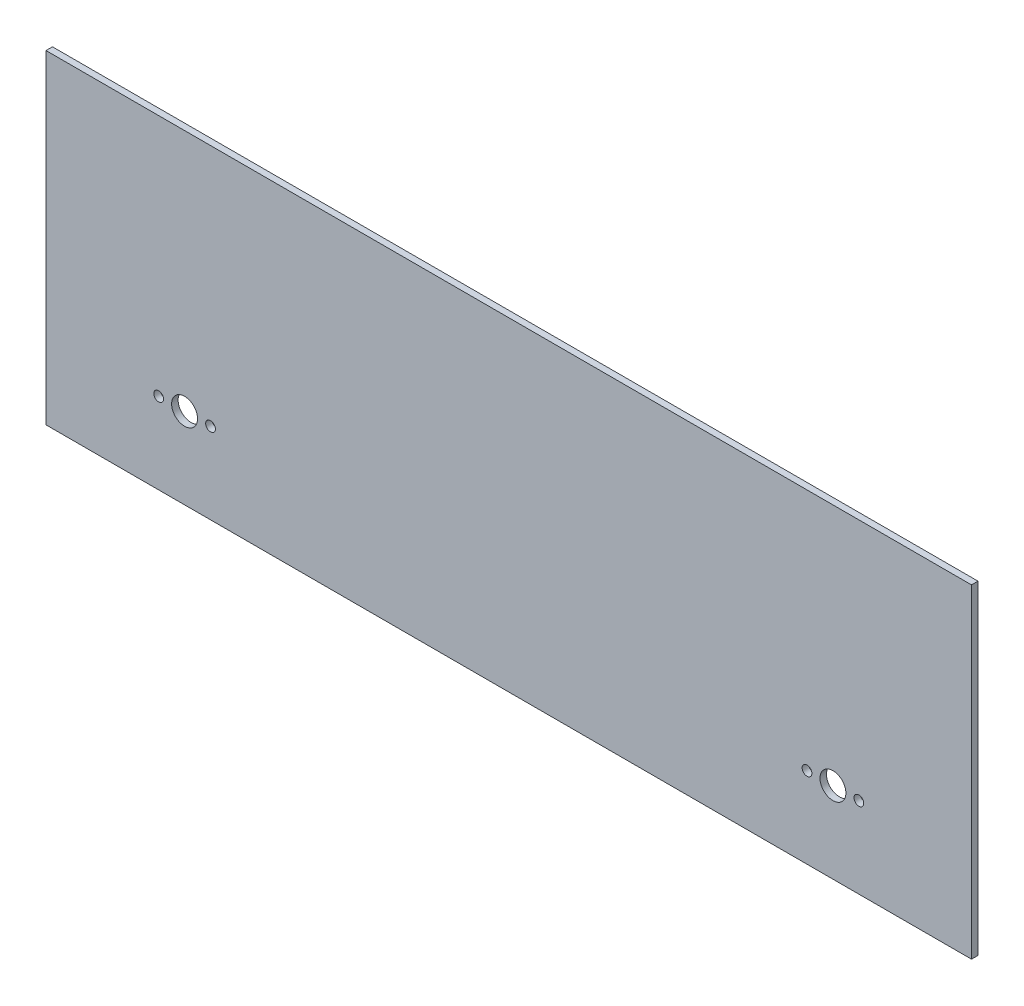
ISO-10303-21;
HEADER;
FILE_DESCRIPTION(('STEP AP214'),'2;1');
FILE_NAME('part.step','',(''),(''),'','','');
FILE_SCHEMA(('AUTOMOTIVE_DESIGN { 1 0 10303 214 1 1 1 1 }'));
ENDSEC;
DATA;
#1=APPLICATION_CONTEXT('core data for automotive mechanical design processes');
#2=APPLICATION_PROTOCOL_DEFINITION('international standard','automotive_design',2000,#1);
#3=PRODUCT_CONTEXT('',#1,'mechanical');
#4=PRODUCT('Part','Part','',(#3));
#5=PRODUCT_RELATED_PRODUCT_CATEGORY('part','',(#4));
#6=PRODUCT_DEFINITION_FORMATION('','',#4);
#7=PRODUCT_DEFINITION_CONTEXT('part definition',#1,'design');
#8=PRODUCT_DEFINITION('design','',#6,#7);
#9=PRODUCT_DEFINITION_SHAPE('','',#8);
#10=(LENGTH_UNIT() NAMED_UNIT(*) SI_UNIT(.MILLI.,.METRE.));
#11=(NAMED_UNIT(*) PLANE_ANGLE_UNIT() SI_UNIT($,.RADIAN.));
#12=(NAMED_UNIT(*) SI_UNIT($,.STERADIAN.) SOLID_ANGLE_UNIT());
#13=UNCERTAINTY_MEASURE_WITH_UNIT(LENGTH_MEASURE(1.E-05),#10,'distance_accuracy_value','');
#14=(GEOMETRIC_REPRESENTATION_CONTEXT(3) GLOBAL_UNCERTAINTY_ASSIGNED_CONTEXT((#13)) GLOBAL_UNIT_ASSIGNED_CONTEXT((#10,
#11,#12)) REPRESENTATION_CONTEXT('',''));
#15=CARTESIAN_POINT('',(0.,0.,0.));
#16=DIRECTION('',(0.,0.,1.));
#17=DIRECTION('',(1.,0.,0.));
#18=AXIS2_PLACEMENT_3D('',#15,#16,#17);
#19=CARTESIAN_POINT('',(0.,0.,2.));
#20=DIRECTION('',(0.,0.,1.));
#21=DIRECTION('',(1.,0.,0.));
#22=AXIS2_PLACEMENT_3D('',#19,#20,#21);
#23=PLANE('',#22);
#24=CARTESIAN_POINT('',(91.9999999999999,-25.,2.));
#25=DIRECTION('',(0.,0.,1.));
#26=DIRECTION('',(-1.,0.,0.));
#27=AXIS2_PLACEMENT_3D('',#24,#25,#26);
#28=CIRCLE('',#27,1.5);
#29=CARTESIAN_POINT('',(90.4999999999999,-25.,2.));
#30=VERTEX_POINT('',#29);
#31=EDGE_CURVE('E132',#30,#30,#28,.T.);
#32=ORIENTED_EDGE('',*,*,#31,.F.);
#33=EDGE_LOOP('',(#32));
#34=FACE_BOUND('',#33,.T.);
#35=CARTESIAN_POINT('',(-108.,-25.,2.));
#36=DIRECTION('',(0.,0.,1.));
#37=DIRECTION('',(1.,0.,0.));
#38=AXIS2_PLACEMENT_3D('',#35,#36,#37);
#39=CIRCLE('',#38,1.5);
#40=CARTESIAN_POINT('',(-106.5,-25.,2.));
#41=VERTEX_POINT('',#40);
#42=EDGE_CURVE('E120',#41,#41,#39,.T.);
#43=ORIENTED_EDGE('',*,*,#42,.F.);
#44=EDGE_LOOP('',(#43));
#45=FACE_BOUND('',#44,.T.);
#46=CARTESIAN_POINT('',(-99.9999999999999,-25.,2.));
#47=DIRECTION('',(0.,0.,1.));
#48=DIRECTION('',(1.,0.,0.));
#49=AXIS2_PLACEMENT_3D('',#46,#47,#48);
#50=CIRCLE('',#49,4.00000000000001);
#51=CARTESIAN_POINT('',(-95.9999999999999,-25.,2.));
#52=VERTEX_POINT('',#51);
#53=EDGE_CURVE('E99',#52,#52,#50,.T.);
#54=ORIENTED_EDGE('',*,*,#53,.F.);
#55=EDGE_LOOP('',(#54));
#56=FACE_BOUND('',#55,.T.);
#57=DIRECTION('',(0.,1.,0.));
#58=VECTOR('',#57,1.);
#59=CARTESIAN_POINT('',(142.75,50.,2.));
#60=LINE('',#59,#58);
#61=CARTESIAN_POINT('',(142.75,-50.,2.));
#62=VERTEX_POINT('',#61);
#63=CARTESIAN_POINT('',(142.75,50.,2.));
#64=VERTEX_POINT('',#63);
#65=EDGE_CURVE('E84',#62,#64,#60,.T.);
#66=ORIENTED_EDGE('',*,*,#65,.T.);
#67=DIRECTION('',(-1.,0.,0.));
#68=VECTOR('',#67,1.);
#69=CARTESIAN_POINT('',(-142.75,50.,2.));
#70=LINE('',#69,#68);
#71=CARTESIAN_POINT('',(-142.75,50.,2.));
#72=VERTEX_POINT('',#71);
#73=EDGE_CURVE('E79',#64,#72,#70,.T.);
#74=ORIENTED_EDGE('',*,*,#73,.T.);
#75=DIRECTION('',(0.,-1.,0.));
#76=VECTOR('',#75,1.);
#77=CARTESIAN_POINT('',(-142.75,50.,2.));
#78=LINE('',#77,#76);
#79=CARTESIAN_POINT('',(-142.75,-50.,2.));
#80=VERTEX_POINT('',#79);
#81=EDGE_CURVE('E82',#72,#80,#78,.T.);
#82=ORIENTED_EDGE('',*,*,#81,.T.);
#83=DIRECTION('',(1.,0.,0.));
#84=VECTOR('',#83,1.);
#85=CARTESIAN_POINT('',(-142.75,-50.,2.));
#86=LINE('',#85,#84);
#87=EDGE_CURVE('E49',#80,#62,#86,.T.);
#88=ORIENTED_EDGE('',*,*,#87,.T.);
#89=EDGE_LOOP('',(#66,#74,#82,#88));
#90=FACE_BOUND('',#89,.T.);
#91=CARTESIAN_POINT('',(-91.9999999999999,-25.,2.));
#92=DIRECTION('',(0.,0.,1.));
#93=DIRECTION('',(1.,0.,0.));
#94=AXIS2_PLACEMENT_3D('',#91,#92,#93);
#95=CIRCLE('',#94,1.5);
#96=CARTESIAN_POINT('',(-90.4999999999999,-25.,2.));
#97=VERTEX_POINT('',#96);
#98=EDGE_CURVE('E114',#97,#97,#95,.T.);
#99=ORIENTED_EDGE('',*,*,#98,.F.);
#100=EDGE_LOOP('',(#99));
#101=FACE_BOUND('',#100,.T.);
#102=CARTESIAN_POINT('',(108.,-25.,2.));
#103=DIRECTION('',(0.,0.,1.));
#104=DIRECTION('',(-1.,0.,0.));
#105=AXIS2_PLACEMENT_3D('',#102,#103,#104);
#106=CIRCLE('',#105,1.5);
#107=CARTESIAN_POINT('',(106.5,-25.,2.));
#108=VERTEX_POINT('',#107);
#109=EDGE_CURVE('E126',#108,#108,#106,.T.);
#110=ORIENTED_EDGE('',*,*,#109,.F.);
#111=EDGE_LOOP('',(#110));
#112=FACE_BOUND('',#111,.T.);
#113=CARTESIAN_POINT('',(99.9999999999999,-25.,2.));
#114=DIRECTION('',(0.,0.,1.));
#115=DIRECTION('',(-1.,0.,0.));
#116=AXIS2_PLACEMENT_3D('',#113,#114,#115);
#117=CIRCLE('',#116,4.00000000000001);
#118=CARTESIAN_POINT('',(95.9999999999999,-25.,2.));
#119=VERTEX_POINT('',#118);
#120=EDGE_CURVE('E138',#119,#119,#117,.T.);
#121=ORIENTED_EDGE('',*,*,#120,.F.);
#122=EDGE_LOOP('',(#121));
#123=FACE_BOUND('',#122,.T.);
#124=ADVANCED_FACE('F32',(#34,#45,#56,#90,#101,#112,#123),#23,.T.);
#125=CARTESIAN_POINT('',(0.,0.,0.));
#126=DIRECTION('',(0.,0.,1.));
#127=DIRECTION('',(1.,0.,0.));
#128=AXIS2_PLACEMENT_3D('',#125,#126,#127);
#129=PLANE('',#128);
#130=DIRECTION('',(0.,1.,0.));
#131=VECTOR('',#130,1.);
#132=CARTESIAN_POINT('',(142.75,50.,0.));
#133=LINE('',#132,#131);
#134=CARTESIAN_POINT('',(142.75,-50.,0.));
#135=VERTEX_POINT('',#134);
#136=CARTESIAN_POINT('',(142.75,50.,0.));
#137=VERTEX_POINT('',#136);
#138=EDGE_CURVE('E96',#135,#137,#133,.T.);
#139=ORIENTED_EDGE('',*,*,#138,.F.);
#140=DIRECTION('',(1.,0.,0.));
#141=VECTOR('',#140,1.);
#142=CARTESIAN_POINT('',(-142.75,-50.,0.));
#143=LINE('',#142,#141);
#144=CARTESIAN_POINT('',(-142.75,-50.,0.));
#145=VERTEX_POINT('',#144);
#146=EDGE_CURVE('E72',#145,#135,#143,.T.);
#147=ORIENTED_EDGE('',*,*,#146,.F.);
#148=DIRECTION('',(0.,-1.,0.));
#149=VECTOR('',#148,1.);
#150=CARTESIAN_POINT('',(-142.75,50.,0.));
#151=LINE('',#150,#149);
#152=CARTESIAN_POINT('',(-142.75,50.,0.));
#153=VERTEX_POINT('',#152);
#154=EDGE_CURVE('E66',#153,#145,#151,.T.);
#155=ORIENTED_EDGE('',*,*,#154,.F.);
#156=DIRECTION('',(-1.,0.,0.));
#157=VECTOR('',#156,1.);
#158=CARTESIAN_POINT('',(-142.75,50.,0.));
#159=LINE('',#158,#157);
#160=EDGE_CURVE('E88',#137,#153,#159,.T.);
#161=ORIENTED_EDGE('',*,*,#160,.F.);
#162=EDGE_LOOP('',(#139,#147,#155,#161));
#163=FACE_BOUND('',#162,.T.);
#164=CARTESIAN_POINT('',(-99.9999999999999,-25.,0.));
#165=DIRECTION('',(0.,0.,1.));
#166=DIRECTION('',(1.,0.,0.));
#167=AXIS2_PLACEMENT_3D('',#164,#165,#166);
#168=CIRCLE('',#167,4.00000000000001);
#169=CARTESIAN_POINT('',(-95.9999999999999,-25.,0.));
#170=VERTEX_POINT('',#169);
#171=EDGE_CURVE('E111',#170,#170,#168,.T.);
#172=ORIENTED_EDGE('',*,*,#171,.T.);
#173=EDGE_LOOP('',(#172));
#174=FACE_BOUND('',#173,.T.);
#175=CARTESIAN_POINT('',(-91.9999999999999,-25.,0.));
#176=DIRECTION('',(0.,0.,1.));
#177=DIRECTION('',(1.,0.,0.));
#178=AXIS2_PLACEMENT_3D('',#175,#176,#177);
#179=CIRCLE('',#178,1.5);
#180=CARTESIAN_POINT('',(-90.4999999999999,-25.,0.));
#181=VERTEX_POINT('',#180);
#182=EDGE_CURVE('E117',#181,#181,#179,.T.);
#183=ORIENTED_EDGE('',*,*,#182,.T.);
#184=EDGE_LOOP('',(#183));
#185=FACE_BOUND('',#184,.T.);
#186=CARTESIAN_POINT('',(-108.,-25.,0.));
#187=DIRECTION('',(0.,0.,1.));
#188=DIRECTION('',(1.,0.,0.));
#189=AXIS2_PLACEMENT_3D('',#186,#187,#188);
#190=CIRCLE('',#189,1.5);
#191=CARTESIAN_POINT('',(-106.5,-25.,0.));
#192=VERTEX_POINT('',#191);
#193=EDGE_CURVE('E123',#192,#192,#190,.T.);
#194=ORIENTED_EDGE('',*,*,#193,.T.);
#195=EDGE_LOOP('',(#194));
#196=FACE_BOUND('',#195,.T.);
#197=CARTESIAN_POINT('',(108.,-25.,0.));
#198=DIRECTION('',(0.,0.,1.));
#199=DIRECTION('',(-1.,0.,0.));
#200=AXIS2_PLACEMENT_3D('',#197,#198,#199);
#201=CIRCLE('',#200,1.5);
#202=CARTESIAN_POINT('',(106.5,-25.,0.));
#203=VERTEX_POINT('',#202);
#204=EDGE_CURVE('E129',#203,#203,#201,.T.);
#205=ORIENTED_EDGE('',*,*,#204,.T.);
#206=EDGE_LOOP('',(#205));
#207=FACE_BOUND('',#206,.T.);
#208=CARTESIAN_POINT('',(91.9999999999999,-25.,0.));
#209=DIRECTION('',(0.,0.,1.));
#210=DIRECTION('',(-1.,0.,0.));
#211=AXIS2_PLACEMENT_3D('',#208,#209,#210);
#212=CIRCLE('',#211,1.5);
#213=CARTESIAN_POINT('',(90.4999999999999,-25.,0.));
#214=VERTEX_POINT('',#213);
#215=EDGE_CURVE('E135',#214,#214,#212,.T.);
#216=ORIENTED_EDGE('',*,*,#215,.T.);
#217=EDGE_LOOP('',(#216));
#218=FACE_BOUND('',#217,.T.);
#219=CARTESIAN_POINT('',(99.9999999999999,-25.,0.));
#220=DIRECTION('',(0.,0.,1.));
#221=DIRECTION('',(-1.,0.,0.));
#222=AXIS2_PLACEMENT_3D('',#219,#220,#221);
#223=CIRCLE('',#222,4.00000000000001);
#224=CARTESIAN_POINT('',(95.9999999999999,-25.,0.));
#225=VERTEX_POINT('',#224);
#226=EDGE_CURVE('E141',#225,#225,#223,.T.);
#227=ORIENTED_EDGE('',*,*,#226,.T.);
#228=EDGE_LOOP('',(#227));
#229=FACE_BOUND('',#228,.T.);
#230=ADVANCED_FACE('F107',(#163,#174,#185,#196,#207,#218,#229),#129,.F.);
#231=CARTESIAN_POINT('',(142.75,50.,2.));
#232=DIRECTION('',(-1.,0.,0.));
#233=DIRECTION('',(0.,0.,1.));
#234=AXIS2_PLACEMENT_3D('',#231,#232,#233);
#235=PLANE('',#234);
#236=ORIENTED_EDGE('',*,*,#138,.T.);
#237=DIRECTION('',(0.,0.,-1.));
#238=VECTOR('',#237,1.);
#239=CARTESIAN_POINT('',(142.75,50.,2.));
#240=LINE('',#239,#238);
#241=EDGE_CURVE('E11',#64,#137,#240,.T.);
#242=ORIENTED_EDGE('',*,*,#241,.F.);
#243=ORIENTED_EDGE('',*,*,#65,.F.);
#244=DIRECTION('',(0.,0.,-1.));
#245=VECTOR('',#244,1.);
#246=CARTESIAN_POINT('',(142.75,-50.,2.));
#247=LINE('',#246,#245);
#248=EDGE_CURVE('E92',#62,#135,#247,.T.);
#249=ORIENTED_EDGE('',*,*,#248,.T.);
#250=EDGE_LOOP('',(#236,#242,#243,#249));
#251=FACE_BOUND('',#250,.T.);
#252=ADVANCED_FACE('F34',(#251),#235,.F.);
#253=CARTESIAN_POINT('',(-142.75,50.,2.));
#254=DIRECTION('',(0.,-1.,0.));
#255=DIRECTION('',(0.,0.,-1.));
#256=AXIS2_PLACEMENT_3D('',#253,#254,#255);
#257=PLANE('',#256);
#258=ORIENTED_EDGE('',*,*,#160,.T.);
#259=DIRECTION('',(0.,0.,-1.));
#260=VECTOR('',#259,1.);
#261=CARTESIAN_POINT('',(-142.75,50.,2.));
#262=LINE('',#261,#260);
#263=EDGE_CURVE('E41',#72,#153,#262,.T.);
#264=ORIENTED_EDGE('',*,*,#263,.F.);
#265=ORIENTED_EDGE('',*,*,#73,.F.);
#266=ORIENTED_EDGE('',*,*,#241,.T.);
#267=EDGE_LOOP('',(#258,#264,#265,#266));
#268=FACE_BOUND('',#267,.T.);
#269=ADVANCED_FACE('F87',(#268),#257,.F.);
#270=CARTESIAN_POINT('',(-142.75,50.,2.));
#271=DIRECTION('',(1.,0.,0.));
#272=DIRECTION('',(0.,0.,-1.));
#273=AXIS2_PLACEMENT_3D('',#270,#271,#272);
#274=PLANE('',#273);
#275=ORIENTED_EDGE('',*,*,#154,.T.);
#276=DIRECTION('',(0.,0.,-1.));
#277=VECTOR('',#276,1.);
#278=CARTESIAN_POINT('',(-142.75,-50.,2.));
#279=LINE('',#278,#277);
#280=EDGE_CURVE('E89',#80,#145,#279,.T.);
#281=ORIENTED_EDGE('',*,*,#280,.F.);
#282=ORIENTED_EDGE('',*,*,#81,.F.);
#283=ORIENTED_EDGE('',*,*,#263,.T.);
#284=EDGE_LOOP('',(#275,#281,#282,#283));
#285=FACE_BOUND('',#284,.T.);
#286=ADVANCED_FACE('F90',(#285),#274,.F.);
#287=CARTESIAN_POINT('',(-142.75,-50.,2.));
#288=DIRECTION('',(0.,1.,0.));
#289=DIRECTION('',(0.,0.,1.));
#290=AXIS2_PLACEMENT_3D('',#287,#288,#289);
#291=PLANE('',#290);
#292=ORIENTED_EDGE('',*,*,#146,.T.);
#293=ORIENTED_EDGE('',*,*,#248,.F.);
#294=ORIENTED_EDGE('',*,*,#87,.F.);
#295=ORIENTED_EDGE('',*,*,#280,.T.);
#296=EDGE_LOOP('',(#292,#293,#294,#295));
#297=FACE_BOUND('',#296,.T.);
#298=ADVANCED_FACE('F104',(#297),#291,.F.);
#299=CARTESIAN_POINT('',(-99.9999999999999,-25.,2.));
#300=DIRECTION('',(0.,0.,-1.));
#301=DIRECTION('',(-1.,0.,0.));
#302=AXIS2_PLACEMENT_3D('',#299,#300,#301);
#303=CYLINDRICAL_SURFACE('',#302,4.00000000000001);
#304=ORIENTED_EDGE('',*,*,#53,.T.);
#305=EDGE_LOOP('',(#304));
#306=FACE_BOUND('',#305,.T.);
#307=ORIENTED_EDGE('',*,*,#171,.F.);
#308=EDGE_LOOP('',(#307));
#309=FACE_BOUND('',#308,.T.);
#310=ADVANCED_FACE('F160',(#306,#309),#303,.F.);
#311=CARTESIAN_POINT('',(-91.9999999999999,-25.,2.));
#312=DIRECTION('',(0.,0.,-1.));
#313=DIRECTION('',(-1.,0.,0.));
#314=AXIS2_PLACEMENT_3D('',#311,#312,#313);
#315=CYLINDRICAL_SURFACE('',#314,1.5);
#316=ORIENTED_EDGE('',*,*,#98,.T.);
#317=EDGE_LOOP('',(#316));
#318=FACE_BOUND('',#317,.T.);
#319=ORIENTED_EDGE('',*,*,#182,.F.);
#320=EDGE_LOOP('',(#319));
#321=FACE_BOUND('',#320,.T.);
#322=ADVANCED_FACE('F206',(#318,#321),#315,.F.);
#323=CARTESIAN_POINT('',(-108.,-25.,2.));
#324=DIRECTION('',(0.,0.,-1.));
#325=DIRECTION('',(-1.,0.,0.));
#326=AXIS2_PLACEMENT_3D('',#323,#324,#325);
#327=CYLINDRICAL_SURFACE('',#326,1.5);
#328=ORIENTED_EDGE('',*,*,#42,.T.);
#329=EDGE_LOOP('',(#328));
#330=FACE_BOUND('',#329,.T.);
#331=ORIENTED_EDGE('',*,*,#193,.F.);
#332=EDGE_LOOP('',(#331));
#333=FACE_BOUND('',#332,.T.);
#334=ADVANCED_FACE('F214',(#330,#333),#327,.F.);
#335=CARTESIAN_POINT('',(108.,-25.,2.));
#336=DIRECTION('',(0.,0.,-1.));
#337=DIRECTION('',(-1.,0.,0.));
#338=AXIS2_PLACEMENT_3D('',#335,#336,#337);
#339=CYLINDRICAL_SURFACE('',#338,1.5);
#340=ORIENTED_EDGE('',*,*,#109,.T.);
#341=EDGE_LOOP('',(#340));
#342=FACE_BOUND('',#341,.T.);
#343=ORIENTED_EDGE('',*,*,#204,.F.);
#344=EDGE_LOOP('',(#343));
#345=FACE_BOUND('',#344,.T.);
#346=ADVANCED_FACE('F222',(#342,#345),#339,.F.);
#347=CARTESIAN_POINT('',(91.9999999999999,-25.,2.));
#348=DIRECTION('',(0.,0.,-1.));
#349=DIRECTION('',(-1.,0.,0.));
#350=AXIS2_PLACEMENT_3D('',#347,#348,#349);
#351=CYLINDRICAL_SURFACE('',#350,1.5);
#352=ORIENTED_EDGE('',*,*,#31,.T.);
#353=EDGE_LOOP('',(#352));
#354=FACE_BOUND('',#353,.T.);
#355=ORIENTED_EDGE('',*,*,#215,.F.);
#356=EDGE_LOOP('',(#355));
#357=FACE_BOUND('',#356,.T.);
#358=ADVANCED_FACE('F231',(#354,#357),#351,.F.);
#359=CARTESIAN_POINT('',(99.9999999999999,-25.,2.));
#360=DIRECTION('',(0.,0.,-1.));
#361=DIRECTION('',(-1.,0.,0.));
#362=AXIS2_PLACEMENT_3D('',#359,#360,#361);
#363=CYLINDRICAL_SURFACE('',#362,4.00000000000001);
#364=ORIENTED_EDGE('',*,*,#120,.T.);
#365=EDGE_LOOP('',(#364));
#366=FACE_BOUND('',#365,.T.);
#367=ORIENTED_EDGE('',*,*,#226,.F.);
#368=EDGE_LOOP('',(#367));
#369=FACE_BOUND('',#368,.T.);
#370=ADVANCED_FACE('F147',(#366,#369),#363,.F.);
#371=CLOSED_SHELL('',(#124,#230,#252,#269,#286,#298,#310,#322,#334,#346,#358,#370));
#372=MANIFOLD_SOLID_BREP('B2',#371);
#373=ADVANCED_BREP_SHAPE_REPRESENTATION('',(#18,#372),#14);
#374=SHAPE_DEFINITION_REPRESENTATION(#9,#373);
ENDSEC;
END-ISO-10303-21;
